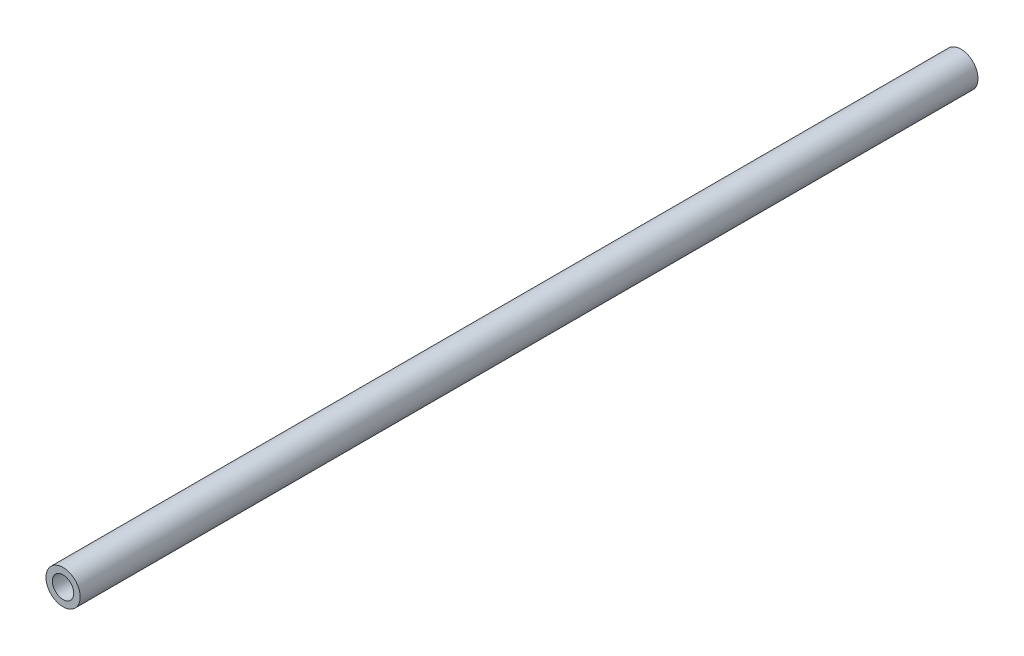
ISO-10303-21;
HEADER;
FILE_DESCRIPTION(('STEP AP214'),'2;1');
FILE_NAME('part.step','',(''),(''),'','','');
FILE_SCHEMA(('AUTOMOTIVE_DESIGN { 1 0 10303 214 1 1 1 1 }'));
ENDSEC;
DATA;
#1=APPLICATION_CONTEXT('core data for automotive mechanical design processes');
#2=APPLICATION_PROTOCOL_DEFINITION('international standard','automotive_design',2000,#1);
#3=PRODUCT_CONTEXT('',#1,'mechanical');
#4=PRODUCT('Part','Part','',(#3));
#5=PRODUCT_RELATED_PRODUCT_CATEGORY('part','',(#4));
#6=PRODUCT_DEFINITION_FORMATION('','',#4);
#7=PRODUCT_DEFINITION_CONTEXT('part definition',#1,'design');
#8=PRODUCT_DEFINITION('design','',#6,#7);
#9=PRODUCT_DEFINITION_SHAPE('','',#8);
#10=(LENGTH_UNIT() NAMED_UNIT(*) SI_UNIT(.MILLI.,.METRE.));
#11=(NAMED_UNIT(*) PLANE_ANGLE_UNIT() SI_UNIT($,.RADIAN.));
#12=(NAMED_UNIT(*) SI_UNIT($,.STERADIAN.) SOLID_ANGLE_UNIT());
#13=UNCERTAINTY_MEASURE_WITH_UNIT(LENGTH_MEASURE(1.E-05),#10,'distance_accuracy_value','');
#14=(GEOMETRIC_REPRESENTATION_CONTEXT(3) GLOBAL_UNCERTAINTY_ASSIGNED_CONTEXT((#13)) GLOBAL_UNIT_ASSIGNED_CONTEXT((#10,
#11,#12)) REPRESENTATION_CONTEXT('',''));
#15=CARTESIAN_POINT('',(0.,0.,0.));
#16=DIRECTION('',(0.,0.,1.));
#17=DIRECTION('',(1.,0.,0.));
#18=AXIS2_PLACEMENT_3D('',#15,#16,#17);
#19=CARTESIAN_POINT('',(0.,0.,210.));
#20=DIRECTION('',(0.,0.,1.));
#21=DIRECTION('',(1.,0.,0.));
#22=AXIS2_PLACEMENT_3D('',#19,#20,#21);
#23=PLANE('',#22);
#24=CARTESIAN_POINT('',(0.,0.,210.));
#25=DIRECTION('',(0.,0.,1.));
#26=DIRECTION('',(1.,0.,0.));
#27=AXIS2_PLACEMENT_3D('',#24,#25,#26);
#28=CIRCLE('',#27,4.);
#29=CARTESIAN_POINT('',(4.,0.,210.));
#30=VERTEX_POINT('',#29);
#31=EDGE_CURVE('E10',#30,#30,#28,.T.);
#32=ORIENTED_EDGE('',*,*,#31,.T.);
#33=EDGE_LOOP('',(#32));
#34=FACE_BOUND('',#33,.T.);
#35=CARTESIAN_POINT('',(0.,0.,210.));
#36=DIRECTION('',(0.,0.,1.));
#37=DIRECTION('',(1.,0.,0.));
#38=AXIS2_PLACEMENT_3D('',#35,#36,#37);
#39=CIRCLE('',#38,2.5);
#40=CARTESIAN_POINT('',(2.5,0.,210.));
#41=VERTEX_POINT('',#40);
#42=EDGE_CURVE('E50',#41,#41,#39,.T.);
#43=ORIENTED_EDGE('',*,*,#42,.F.);
#44=EDGE_LOOP('',(#43));
#45=FACE_BOUND('',#44,.T.);
#46=ADVANCED_FACE('F37',(#34,#45),#23,.T.);
#47=CARTESIAN_POINT('',(0.,0.,0.));
#48=DIRECTION('',(0.,0.,1.));
#49=DIRECTION('',(1.,0.,0.));
#50=AXIS2_PLACEMENT_3D('',#47,#48,#49);
#51=PLANE('',#50);
#52=CARTESIAN_POINT('',(0.,0.,0.));
#53=DIRECTION('',(0.,0.,1.));
#54=DIRECTION('',(1.,0.,0.));
#55=AXIS2_PLACEMENT_3D('',#52,#53,#54);
#56=CIRCLE('',#55,4.);
#57=CARTESIAN_POINT('',(4.,0.,0.));
#58=VERTEX_POINT('',#57);
#59=EDGE_CURVE('E41',#58,#58,#56,.T.);
#60=ORIENTED_EDGE('',*,*,#59,.F.);
#61=EDGE_LOOP('',(#60));
#62=FACE_BOUND('',#61,.T.);
#63=CARTESIAN_POINT('',(0.,0.,0.));
#64=DIRECTION('',(0.,0.,1.));
#65=DIRECTION('',(1.,0.,0.));
#66=AXIS2_PLACEMENT_3D('',#63,#64,#65);
#67=CIRCLE('',#66,2.5);
#68=CARTESIAN_POINT('',(2.5,0.,0.));
#69=VERTEX_POINT('',#68);
#70=EDGE_CURVE('E52',#69,#69,#67,.T.);
#71=ORIENTED_EDGE('',*,*,#70,.T.);
#72=EDGE_LOOP('',(#71));
#73=FACE_BOUND('',#72,.T.);
#74=ADVANCED_FACE('F64',(#62,#73),#51,.F.);
#75=CARTESIAN_POINT('',(0.,0.,210.));
#76=DIRECTION('',(0.,0.,-1.));
#77=DIRECTION('',(-1.,0.,0.));
#78=AXIS2_PLACEMENT_3D('',#75,#76,#77);
#79=CYLINDRICAL_SURFACE('',#78,4.);
#80=ORIENTED_EDGE('',*,*,#31,.F.);
#81=EDGE_LOOP('',(#80));
#82=FACE_BOUND('',#81,.T.);
#83=ORIENTED_EDGE('',*,*,#59,.T.);
#84=EDGE_LOOP('',(#83));
#85=FACE_BOUND('',#84,.T.);
#86=ADVANCED_FACE('F39',(#82,#85),#79,.T.);
#87=CARTESIAN_POINT('',(0.,0.,210.));
#88=DIRECTION('',(0.,0.,-1.));
#89=DIRECTION('',(-1.,0.,0.));
#90=AXIS2_PLACEMENT_3D('',#87,#88,#89);
#91=CYLINDRICAL_SURFACE('',#90,2.5);
#92=ORIENTED_EDGE('',*,*,#42,.T.);
#93=EDGE_LOOP('',(#92));
#94=FACE_BOUND('',#93,.T.);
#95=ORIENTED_EDGE('',*,*,#70,.F.);
#96=EDGE_LOOP('',(#95));
#97=FACE_BOUND('',#96,.T.);
#98=ADVANCED_FACE('F60',(#94,#97),#91,.F.);
#99=CLOSED_SHELL('',(#46,#74,#86,#98));
#100=MANIFOLD_SOLID_BREP('B2',#99);
#101=ADVANCED_BREP_SHAPE_REPRESENTATION('',(#18,#100),#14);
#102=SHAPE_DEFINITION_REPRESENTATION(#9,#101);
ENDSEC;
END-ISO-10303-21;
